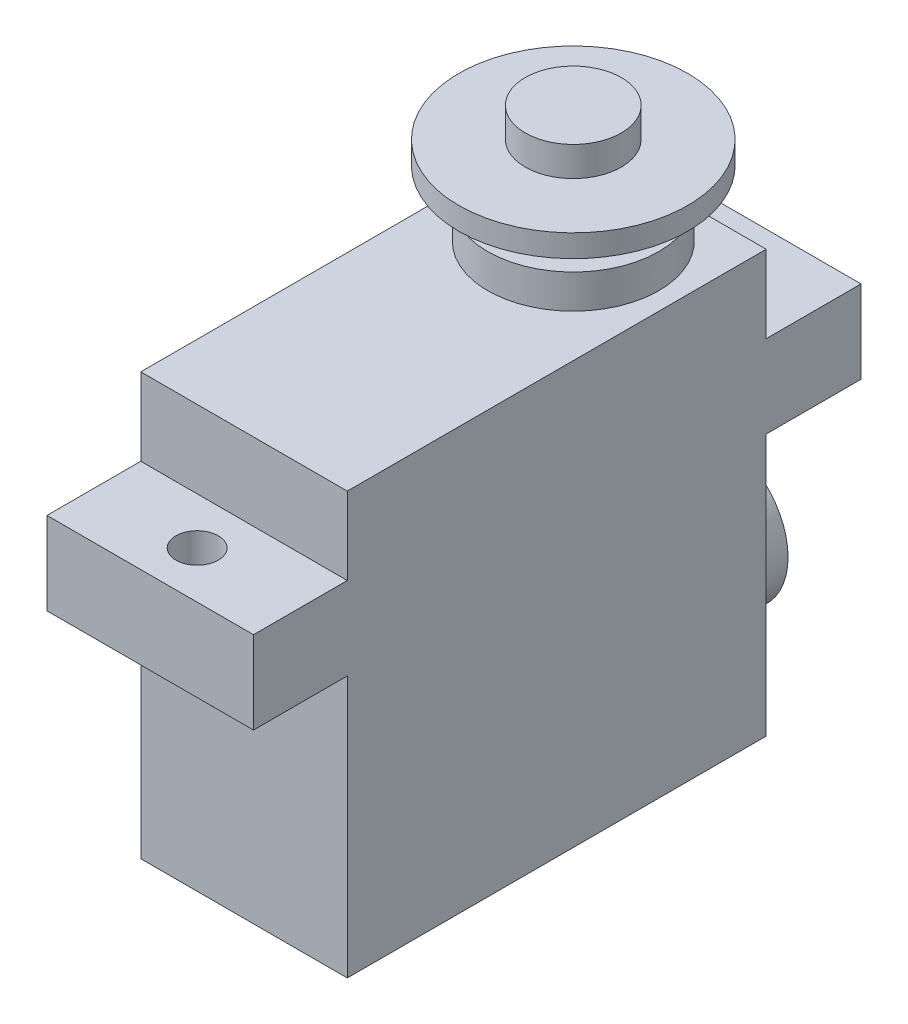
ISO-10303-21;
HEADER;
FILE_DESCRIPTION(('STEP AP214'),'2;1');
FILE_NAME('part.step','',(''),(''),'','','');
FILE_SCHEMA(('AUTOMOTIVE_DESIGN { 1 0 10303 214 1 1 1 1 }'));
ENDSEC;
DATA;
#1=APPLICATION_CONTEXT('core data for automotive mechanical design processes');
#2=APPLICATION_PROTOCOL_DEFINITION('international standard','automotive_design',2000,#1);
#3=PRODUCT_CONTEXT('',#1,'mechanical');
#4=PRODUCT('Part','Part','',(#3));
#5=PRODUCT_RELATED_PRODUCT_CATEGORY('part','',(#4));
#6=PRODUCT_DEFINITION_FORMATION('','',#4);
#7=PRODUCT_DEFINITION_CONTEXT('part definition',#1,'design');
#8=PRODUCT_DEFINITION('design','',#6,#7);
#9=PRODUCT_DEFINITION_SHAPE('','',#8);
#10=(LENGTH_UNIT() NAMED_UNIT(*) SI_UNIT(.MILLI.,.METRE.));
#11=(NAMED_UNIT(*) PLANE_ANGLE_UNIT() SI_UNIT($,.RADIAN.));
#12=(NAMED_UNIT(*) SI_UNIT($,.STERADIAN.) SOLID_ANGLE_UNIT());
#13=UNCERTAINTY_MEASURE_WITH_UNIT(LENGTH_MEASURE(1.E-05),#10,'distance_accuracy_value','');
#14=(GEOMETRIC_REPRESENTATION_CONTEXT(3) GLOBAL_UNCERTAINTY_ASSIGNED_CONTEXT((#13)) GLOBAL_UNIT_ASSIGNED_CONTEXT((#10,
#11,#12)) REPRESENTATION_CONTEXT('',''));
#15=CARTESIAN_POINT('',(0.,0.,0.));
#16=DIRECTION('',(0.,0.,1.));
#17=DIRECTION('',(1.,0.,0.));
#18=AXIS2_PLACEMENT_3D('',#15,#16,#17);
#19=CARTESIAN_POINT('',(0.,31.115,0.));
#20=DIRECTION('',(0.,0.,-1.));
#21=DIRECTION('',(-1.,0.,0.));
#22=AXIS2_PLACEMENT_3D('',#19,#20,#21);
#23=PLANE('',#22);
#24=DIRECTION('',(0.,-1.,0.));
#25=VECTOR('',#24,1.);
#26=CARTESIAN_POINT('',(0.,31.115,0.));
#27=LINE('',#26,#25);
#28=CARTESIAN_POINT('',(0.,31.115,0.));
#29=VERTEX_POINT('',#28);
#30=CARTESIAN_POINT('',(0.,25.4,0.));
#31=VERTEX_POINT('',#30);
#32=EDGE_CURVE('E221',#29,#31,#27,.T.);
#33=ORIENTED_EDGE('',*,*,#32,.T.);
#34=DIRECTION('',(1.,0.,0.));
#35=VECTOR('',#34,1.);
#36=CARTESIAN_POINT('',(0.,25.4,0.));
#37=LINE('',#36,#35);
#38=CARTESIAN_POINT('',(15.2399999999999,25.4,0.));
#39=VERTEX_POINT('',#38);
#40=EDGE_CURVE('E186',#31,#39,#37,.T.);
#41=ORIENTED_EDGE('',*,*,#40,.T.);
#42=DIRECTION('',(0.,-1.,0.));
#43=VECTOR('',#42,1.);
#44=CARTESIAN_POINT('',(15.2399999999999,31.115,0.));
#45=LINE('',#44,#43);
#46=CARTESIAN_POINT('',(15.2399999999999,31.115,0.));
#47=VERTEX_POINT('',#46);
#48=EDGE_CURVE('E218',#47,#39,#45,.T.);
#49=ORIENTED_EDGE('',*,*,#48,.F.);
#50=DIRECTION('',(1.,0.,0.));
#51=VECTOR('',#50,1.);
#52=CARTESIAN_POINT('',(0.,31.115,0.));
#53=LINE('',#52,#51);
#54=EDGE_CURVE('E193',#29,#47,#53,.T.);
#55=ORIENTED_EDGE('',*,*,#54,.F.);
#56=EDGE_LOOP('',(#33,#41,#49,#55));
#57=FACE_BOUND('',#56,.T.);
#58=ADVANCED_FACE('F43',(#57),#23,.F.);
#59=CARTESIAN_POINT('',(0.,31.115,-30.9117999999999));
#60=DIRECTION('',(0.,0.,1.));
#61=DIRECTION('',(1.,0.,0.));
#62=AXIS2_PLACEMENT_3D('',#59,#60,#61);
#63=PLANE('',#62);
#64=DIRECTION('',(0.,-1.,0.));
#65=VECTOR('',#64,1.);
#66=CARTESIAN_POINT('',(15.2399999999999,31.115,-30.9118));
#67=LINE('',#66,#65);
#68=CARTESIAN_POINT('',(15.2399999999999,31.115,-30.9118));
#69=VERTEX_POINT('',#68);
#70=CARTESIAN_POINT('',(15.2399999999999,25.4,-30.9118));
#71=VERTEX_POINT('',#70);
#72=EDGE_CURVE('E214',#69,#71,#67,.T.);
#73=ORIENTED_EDGE('',*,*,#72,.T.);
#74=DIRECTION('',(-1.,0.,0.));
#75=VECTOR('',#74,1.);
#76=CARTESIAN_POINT('',(0.,25.4,-30.9117999999999));
#77=LINE('',#76,#75);
#78=CARTESIAN_POINT('',(0.,25.4,-30.9118));
#79=VERTEX_POINT('',#78);
#80=EDGE_CURVE('E226',#71,#79,#77,.T.);
#81=ORIENTED_EDGE('',*,*,#80,.T.);
#82=DIRECTION('',(0.,-1.,0.));
#83=VECTOR('',#82,1.);
#84=CARTESIAN_POINT('',(0.,31.115,-30.9117999999999));
#85=LINE('',#84,#83);
#86=CARTESIAN_POINT('',(0.,31.115,-30.9117999999999));
#87=VERTEX_POINT('',#86);
#88=EDGE_CURVE('E210',#87,#79,#85,.T.);
#89=ORIENTED_EDGE('',*,*,#88,.F.);
#90=DIRECTION('',(-1.,0.,0.));
#91=VECTOR('',#90,1.);
#92=CARTESIAN_POINT('',(0.,31.115,-30.9117999999999));
#93=LINE('',#92,#91);
#94=EDGE_CURVE('E198',#69,#87,#93,.T.);
#95=ORIENTED_EDGE('',*,*,#94,.F.);
#96=EDGE_LOOP('',(#73,#81,#89,#95));
#97=FACE_BOUND('',#96,.T.);
#98=ADVANCED_FACE('F296',(#97),#63,.F.);
#99=CARTESIAN_POINT('',(0.,31.115,0.));
#100=DIRECTION('',(1.,0.,0.));
#101=DIRECTION('',(0.,0.,-1.));
#102=AXIS2_PLACEMENT_3D('',#99,#100,#101);
#103=PLANE('',#102);
#104=CARTESIAN_POINT('',(0.,19.304,0.));
#105=VERTEX_POINT('',#104);
#106=CARTESIAN_POINT('',(0.,0.,0.));
#107=VERTEX_POINT('',#106);
#108=EDGE_CURVE('E138',#105,#107,#27,.T.);
#109=ORIENTED_EDGE('',*,*,#108,.F.);
#110=DIRECTION('',(0.,0.,1.));
#111=VECTOR('',#110,1.);
#112=CARTESIAN_POINT('',(0.,19.304,-37.9095));
#113=LINE('',#112,#111);
#114=CARTESIAN_POINT('',(0.,19.304,6.9215));
#115=VERTEX_POINT('',#114);
#116=EDGE_CURVE('E60',#105,#115,#113,.T.);
#117=ORIENTED_EDGE('',*,*,#116,.T.);
#118=DIRECTION('',(0.,-1.,0.));
#119=VECTOR('',#118,1.);
#120=CARTESIAN_POINT('',(0.,25.4,6.9215));
#121=LINE('',#120,#119);
#122=CARTESIAN_POINT('',(0.,25.4,6.9215));
#123=VERTEX_POINT('',#122);
#124=EDGE_CURVE('E136',#123,#115,#121,.T.);
#125=ORIENTED_EDGE('',*,*,#124,.F.);
#126=DIRECTION('',(0.,0.,1.));
#127=VECTOR('',#126,1.);
#128=CARTESIAN_POINT('',(0.,25.4,-37.9095));
#129=LINE('',#128,#127);
#130=EDGE_CURVE('E178',#31,#123,#129,.T.);
#131=ORIENTED_EDGE('',*,*,#130,.F.);
#132=ORIENTED_EDGE('',*,*,#32,.F.);
#133=DIRECTION('',(0.,0.,1.));
#134=VECTOR('',#133,1.);
#135=CARTESIAN_POINT('',(0.,31.115,0.));
#136=LINE('',#135,#134);
#137=EDGE_CURVE('E190',#87,#29,#136,.T.);
#138=ORIENTED_EDGE('',*,*,#137,.F.);
#139=ORIENTED_EDGE('',*,*,#88,.T.);
#140=CARTESIAN_POINT('',(0.,25.4,-37.9095));
#141=VERTEX_POINT('',#140);
#142=EDGE_CURVE('E175',#141,#79,#129,.T.);
#143=ORIENTED_EDGE('',*,*,#142,.F.);
#144=DIRECTION('',(0.,-1.,0.));
#145=VECTOR('',#144,1.);
#146=CARTESIAN_POINT('',(0.,25.4,-37.9095));
#147=LINE('',#146,#145);
#148=CARTESIAN_POINT('',(0.,19.304,-37.9095));
#149=VERTEX_POINT('',#148);
#150=EDGE_CURVE('E165',#141,#149,#147,.T.);
#151=ORIENTED_EDGE('',*,*,#150,.T.);
#152=CARTESIAN_POINT('',(0.,19.304,-30.9118));
#153=VERTEX_POINT('',#152);
#154=EDGE_CURVE('E139',#149,#153,#113,.T.);
#155=ORIENTED_EDGE('',*,*,#154,.T.);
#156=CARTESIAN_POINT('',(0.,0.,-30.9117999999999));
#157=VERTEX_POINT('',#156);
#158=EDGE_CURVE('E200',#153,#157,#85,.T.);
#159=ORIENTED_EDGE('',*,*,#158,.T.);
#160=DIRECTION('',(0.,0.,1.));
#161=VECTOR('',#160,1.);
#162=CARTESIAN_POINT('',(0.,0.,0.));
#163=LINE('',#162,#161);
#164=EDGE_CURVE('E189',#157,#107,#163,.T.);
#165=ORIENTED_EDGE('',*,*,#164,.T.);
#166=EDGE_LOOP('',(#109,#117,#125,#131,#132,#138,#139,#143,#151,#155,#159,#165));
#167=FACE_BOUND('',#166,.T.);
#168=ADVANCED_FACE('F45',(#167),#103,.F.);
#169=CARTESIAN_POINT('',(15.2399999999999,19.304,0.));
#170=VERTEX_POINT('',#169);
#171=CARTESIAN_POINT('',(15.2399999999999,0.,0.));
#172=VERTEX_POINT('',#171);
#173=EDGE_CURVE('E217',#170,#172,#45,.T.);
#174=ORIENTED_EDGE('',*,*,#173,.F.);
#175=DIRECTION('',(-1.,0.,0.));
#176=VECTOR('',#175,1.);
#177=CARTESIAN_POINT('',(0.,19.304,0.));
#178=LINE('',#177,#176);
#179=EDGE_CURVE('E177',#170,#105,#178,.T.);
#180=ORIENTED_EDGE('',*,*,#179,.T.);
#181=ORIENTED_EDGE('',*,*,#108,.T.);
#182=DIRECTION('',(1.,0.,0.));
#183=VECTOR('',#182,1.);
#184=CARTESIAN_POINT('',(0.,0.,0.));
#185=LINE('',#184,#183);
#186=EDGE_CURVE('E202',#107,#172,#185,.T.);
#187=ORIENTED_EDGE('',*,*,#186,.T.);
#188=EDGE_LOOP('',(#174,#180,#181,#187));
#189=FACE_BOUND('',#188,.T.);
#190=ADVANCED_FACE('F319',(#189),#23,.F.);
#191=CARTESIAN_POINT('',(15.2399999999999,31.115,0.));
#192=DIRECTION('',(-1.,0.,0.));
#193=DIRECTION('',(0.,0.,1.));
#194=AXIS2_PLACEMENT_3D('',#191,#192,#193);
#195=PLANE('',#194);
#196=CARTESIAN_POINT('',(15.2399999999999,19.304,-30.9118));
#197=VERTEX_POINT('',#196);
#198=CARTESIAN_POINT('',(15.2399999999999,0.,-30.9118));
#199=VERTEX_POINT('',#198);
#200=EDGE_CURVE('E213',#197,#199,#67,.T.);
#201=ORIENTED_EDGE('',*,*,#200,.F.);
#202=DIRECTION('',(0.,0.,1.));
#203=VECTOR('',#202,1.);
#204=CARTESIAN_POINT('',(15.2399999999999,19.304,-37.9095));
#205=LINE('',#204,#203);
#206=CARTESIAN_POINT('',(15.2399999999999,19.304,-37.9095));
#207=VERTEX_POINT('',#206);
#208=EDGE_CURVE('E68',#207,#197,#205,.T.);
#209=ORIENTED_EDGE('',*,*,#208,.F.);
#210=DIRECTION('',(0.,1.,0.));
#211=VECTOR('',#210,1.);
#212=CARTESIAN_POINT('',(15.2399999999999,25.4,-37.9095));
#213=LINE('',#212,#211);
#214=CARTESIAN_POINT('',(15.2399999999999,25.4,-37.9095));
#215=VERTEX_POINT('',#214);
#216=EDGE_CURVE('E170',#207,#215,#213,.T.);
#217=ORIENTED_EDGE('',*,*,#216,.T.);
#218=DIRECTION('',(0.,0.,1.));
#219=VECTOR('',#218,1.);
#220=CARTESIAN_POINT('',(15.2399999999999,25.4,-37.9095));
#221=LINE('',#220,#219);
#222=EDGE_CURVE('E179',#215,#71,#221,.T.);
#223=ORIENTED_EDGE('',*,*,#222,.T.);
#224=ORIENTED_EDGE('',*,*,#72,.F.);
#225=DIRECTION('',(0.,0.,-1.));
#226=VECTOR('',#225,1.);
#227=CARTESIAN_POINT('',(15.2399999999999,31.115,0.));
#228=LINE('',#227,#226);
#229=EDGE_CURVE('E196',#47,#69,#228,.T.);
#230=ORIENTED_EDGE('',*,*,#229,.F.);
#231=ORIENTED_EDGE('',*,*,#48,.T.);
#232=CARTESIAN_POINT('',(15.2399999999999,25.4,6.9215));
#233=VERTEX_POINT('',#232);
#234=EDGE_CURVE('E182',#39,#233,#221,.T.);
#235=ORIENTED_EDGE('',*,*,#234,.T.);
#236=DIRECTION('',(0.,1.,0.));
#237=VECTOR('',#236,1.);
#238=CARTESIAN_POINT('',(15.2399999999999,25.4,6.9215));
#239=LINE('',#238,#237);
#240=CARTESIAN_POINT('',(15.2399999999999,19.304,6.9215));
#241=VERTEX_POINT('',#240);
#242=EDGE_CURVE('E150',#241,#233,#239,.T.);
#243=ORIENTED_EDGE('',*,*,#242,.F.);
#244=EDGE_CURVE('E146',#170,#241,#205,.T.);
#245=ORIENTED_EDGE('',*,*,#244,.F.);
#246=ORIENTED_EDGE('',*,*,#173,.T.);
#247=DIRECTION('',(0.,0.,-1.));
#248=VECTOR('',#247,1.);
#249=CARTESIAN_POINT('',(15.2399999999999,0.,0.));
#250=LINE('',#249,#248);
#251=EDGE_CURVE('E205',#172,#199,#250,.T.);
#252=ORIENTED_EDGE('',*,*,#251,.T.);
#253=EDGE_LOOP('',(#201,#209,#217,#223,#224,#230,#231,#235,#243,#245,#246,#252));
#254=FACE_BOUND('',#253,.T.);
#255=ADVANCED_FACE('F291',(#254),#195,.F.);
#256=CARTESIAN_POINT('',(7.61999999999996,8.2804,-30.9118));
#257=DIRECTION('',(0.,0.,1.));
#258=DIRECTION('',(1.,0.,0.));
#259=AXIS2_PLACEMENT_3D('',#256,#257,#258);
#260=CIRCLE('',#259,5.2705);
#261=CARTESIAN_POINT('',(12.8905,8.2804,-30.9118));
#262=VERTEX_POINT('',#261);
#263=EDGE_CURVE('E228',#262,#262,#260,.F.);
#264=ORIENTED_EDGE('',*,*,#263,.F.);
#265=EDGE_LOOP('',(#264));
#266=FACE_BOUND('',#265,.T.);
#267=ORIENTED_EDGE('',*,*,#158,.F.);
#268=DIRECTION('',(1.,0.,0.));
#269=VECTOR('',#268,1.);
#270=CARTESIAN_POINT('',(0.,19.304,-30.9117999999999));
#271=LINE('',#270,#269);
#272=EDGE_CURVE('E224',#153,#197,#271,.T.);
#273=ORIENTED_EDGE('',*,*,#272,.T.);
#274=ORIENTED_EDGE('',*,*,#200,.T.);
#275=DIRECTION('',(-1.,0.,0.));
#276=VECTOR('',#275,1.);
#277=CARTESIAN_POINT('',(0.,0.,-30.9117999999999));
#278=LINE('',#277,#276);
#279=EDGE_CURVE('E194',#199,#157,#278,.T.);
#280=ORIENTED_EDGE('',*,*,#279,.T.);
#281=EDGE_LOOP('',(#267,#273,#274,#280));
#282=FACE_BOUND('',#281,.T.);
#283=ADVANCED_FACE('F310',(#266,#282),#63,.F.);
#284=CARTESIAN_POINT('',(0.,31.115,0.));
#285=DIRECTION('',(0.,-1.,0.));
#286=DIRECTION('',(0.,0.,-1.));
#287=AXIS2_PLACEMENT_3D('',#284,#285,#286);
#288=PLANE('',#287);
#289=CARTESIAN_POINT('',(7.61999999999996,31.115,-24.2951));
#290=DIRECTION('',(0.,-1.,0.));
#291=DIRECTION('',(0.,0.,-1.));
#292=AXIS2_PLACEMENT_3D('',#289,#290,#291);
#293=CIRCLE('',#292,6.3119);
#294=CARTESIAN_POINT('',(7.61999999999996,31.115,-30.607));
#295=VERTEX_POINT('',#294);
#296=EDGE_CURVE('E47',#295,#295,#293,.F.);
#297=ORIENTED_EDGE('',*,*,#296,.F.);
#298=EDGE_LOOP('',(#297));
#299=FACE_BOUND('',#298,.T.);
#300=ORIENTED_EDGE('',*,*,#137,.T.);
#301=ORIENTED_EDGE('',*,*,#54,.T.);
#302=ORIENTED_EDGE('',*,*,#229,.T.);
#303=ORIENTED_EDGE('',*,*,#94,.T.);
#304=EDGE_LOOP('',(#300,#301,#302,#303));
#305=FACE_BOUND('',#304,.T.);
#306=ADVANCED_FACE('F299',(#299,#305),#288,.F.);
#307=CARTESIAN_POINT('',(0.,0.,0.));
#308=DIRECTION('',(0.,-1.,0.));
#309=DIRECTION('',(0.,0.,-1.));
#310=AXIS2_PLACEMENT_3D('',#307,#308,#309);
#311=PLANE('',#310);
#312=ORIENTED_EDGE('',*,*,#164,.F.);
#313=ORIENTED_EDGE('',*,*,#279,.F.);
#314=ORIENTED_EDGE('',*,*,#251,.F.);
#315=ORIENTED_EDGE('',*,*,#186,.F.);
#316=EDGE_LOOP('',(#312,#313,#314,#315));
#317=FACE_BOUND('',#316,.T.);
#318=ADVANCED_FACE('F316',(#317),#311,.T.);
#319=CARTESIAN_POINT('',(0.,0.,-37.9095));
#320=DIRECTION('',(0.,0.,1.));
#321=DIRECTION('',(1.,0.,0.));
#322=AXIS2_PLACEMENT_3D('',#319,#320,#321);
#323=PLANE('',#322);
#324=ORIENTED_EDGE('',*,*,#150,.F.);
#325=DIRECTION('',(-1.,0.,0.));
#326=VECTOR('',#325,1.);
#327=CARTESIAN_POINT('',(0.,25.4,-37.9095));
#328=LINE('',#327,#326);
#329=EDGE_CURVE('E140',#215,#141,#328,.T.);
#330=ORIENTED_EDGE('',*,*,#329,.F.);
#331=ORIENTED_EDGE('',*,*,#216,.F.);
#332=DIRECTION('',(1.,0.,0.));
#333=VECTOR('',#332,1.);
#334=CARTESIAN_POINT('',(0.,19.304,-37.9095));
#335=LINE('',#334,#333);
#336=EDGE_CURVE('E168',#149,#207,#335,.T.);
#337=ORIENTED_EDGE('',*,*,#336,.F.);
#338=EDGE_LOOP('',(#324,#330,#331,#337));
#339=FACE_BOUND('',#338,.T.);
#340=ADVANCED_FACE('F307',(#339),#323,.F.);
#341=CARTESIAN_POINT('',(0.,19.304,-37.9095));
#342=DIRECTION('',(0.,-1.,0.));
#343=DIRECTION('',(0.,0.,-1.));
#344=AXIS2_PLACEMENT_3D('',#341,#342,#343);
#345=PLANE('',#344);
#346=CARTESIAN_POINT('',(7.61999999999996,19.304,-34.41065));
#347=DIRECTION('',(0.,-1.,0.));
#348=DIRECTION('',(0.,0.,-1.));
#349=AXIS2_PLACEMENT_3D('',#346,#347,#348);
#350=CIRCLE('',#349,1.5621);
#351=CARTESIAN_POINT('',(7.61999999999996,19.304,-35.97275));
#352=VERTEX_POINT('',#351);
#353=EDGE_CURVE('E268',#352,#352,#350,.F.);
#354=ORIENTED_EDGE('',*,*,#353,.T.);
#355=EDGE_LOOP('',(#354));
#356=FACE_BOUND('',#355,.T.);
#357=ORIENTED_EDGE('',*,*,#272,.F.);
#358=ORIENTED_EDGE('',*,*,#154,.F.);
#359=ORIENTED_EDGE('',*,*,#336,.T.);
#360=ORIENTED_EDGE('',*,*,#208,.T.);
#361=EDGE_LOOP('',(#357,#358,#359,#360));
#362=FACE_BOUND('',#361,.T.);
#363=ADVANCED_FACE('F272',(#356,#362),#345,.T.);
#364=CARTESIAN_POINT('',(0.,25.4,-37.9095));
#365=DIRECTION('',(0.,1.,0.));
#366=DIRECTION('',(0.,0.,1.));
#367=AXIS2_PLACEMENT_3D('',#364,#365,#366);
#368=PLANE('',#367);
#369=CARTESIAN_POINT('',(7.61999999999996,25.4,-34.41065));
#370=DIRECTION('',(0.,1.,0.));
#371=DIRECTION('',(0.,0.,1.));
#372=AXIS2_PLACEMENT_3D('',#369,#370,#371);
#373=CIRCLE('',#372,1.5621);
#374=CARTESIAN_POINT('',(7.61999999999996,25.4,-32.84855));
#375=VERTEX_POINT('',#374);
#376=EDGE_CURVE('E263',#375,#375,#373,.T.);
#377=ORIENTED_EDGE('',*,*,#376,.F.);
#378=EDGE_LOOP('',(#377));
#379=FACE_BOUND('',#378,.T.);
#380=ORIENTED_EDGE('',*,*,#80,.F.);
#381=ORIENTED_EDGE('',*,*,#222,.F.);
#382=ORIENTED_EDGE('',*,*,#329,.T.);
#383=ORIENTED_EDGE('',*,*,#142,.T.);
#384=EDGE_LOOP('',(#380,#381,#382,#383));
#385=FACE_BOUND('',#384,.T.);
#386=ADVANCED_FACE('F281',(#379,#385),#368,.T.);
#387=CARTESIAN_POINT('',(7.61999999999996,25.4,3.46075));
#388=DIRECTION('',(0.,1.,0.));
#389=DIRECTION('',(0.,0.,1.));
#390=AXIS2_PLACEMENT_3D('',#387,#388,#389);
#391=CIRCLE('',#390,1.5621);
#392=CARTESIAN_POINT('',(7.61999999999996,25.4,5.02285));
#393=VERTEX_POINT('',#392);
#394=EDGE_CURVE('E259',#393,#393,#391,.T.);
#395=ORIENTED_EDGE('',*,*,#394,.F.);
#396=EDGE_LOOP('',(#395));
#397=FACE_BOUND('',#396,.T.);
#398=ORIENTED_EDGE('',*,*,#40,.F.);
#399=ORIENTED_EDGE('',*,*,#130,.T.);
#400=DIRECTION('',(-1.,0.,0.));
#401=VECTOR('',#400,1.);
#402=CARTESIAN_POINT('',(0.,25.4,6.9215));
#403=LINE('',#402,#401);
#404=EDGE_CURVE('E155',#233,#123,#403,.T.);
#405=ORIENTED_EDGE('',*,*,#404,.F.);
#406=ORIENTED_EDGE('',*,*,#234,.F.);
#407=EDGE_LOOP('',(#398,#399,#405,#406));
#408=FACE_BOUND('',#407,.T.);
#409=ADVANCED_FACE('F284',(#397,#408),#368,.T.);
#410=CARTESIAN_POINT('',(7.61999999999996,19.304,3.46075));
#411=DIRECTION('',(0.,-1.,0.));
#412=DIRECTION('',(0.,0.,-1.));
#413=AXIS2_PLACEMENT_3D('',#410,#411,#412);
#414=CIRCLE('',#413,1.5621);
#415=CARTESIAN_POINT('',(7.61999999999996,19.304,1.89865));
#416=VERTEX_POINT('',#415);
#417=EDGE_CURVE('E260',#416,#416,#414,.F.);
#418=ORIENTED_EDGE('',*,*,#417,.T.);
#419=EDGE_LOOP('',(#418));
#420=FACE_BOUND('',#419,.T.);
#421=ORIENTED_EDGE('',*,*,#179,.F.);
#422=ORIENTED_EDGE('',*,*,#244,.T.);
#423=DIRECTION('',(1.,0.,0.));
#424=VECTOR('',#423,1.);
#425=CARTESIAN_POINT('',(0.,19.304,6.9215));
#426=LINE('',#425,#424);
#427=EDGE_CURVE('E143',#115,#241,#426,.T.);
#428=ORIENTED_EDGE('',*,*,#427,.F.);
#429=ORIENTED_EDGE('',*,*,#116,.F.);
#430=EDGE_LOOP('',(#421,#422,#428,#429));
#431=FACE_BOUND('',#430,.T.);
#432=ADVANCED_FACE('F144',(#420,#431),#345,.T.);
#433=CARTESIAN_POINT('',(0.,0.,6.9215));
#434=DIRECTION('',(0.,0.,1.));
#435=DIRECTION('',(1.,0.,0.));
#436=AXIS2_PLACEMENT_3D('',#433,#434,#435);
#437=PLANE('',#436);
#438=ORIENTED_EDGE('',*,*,#124,.T.);
#439=ORIENTED_EDGE('',*,*,#427,.T.);
#440=ORIENTED_EDGE('',*,*,#242,.T.);
#441=ORIENTED_EDGE('',*,*,#404,.T.);
#442=EDGE_LOOP('',(#438,#439,#440,#441));
#443=FACE_BOUND('',#442,.T.);
#444=ADVANCED_FACE('F153',(#443),#437,.T.);
#445=CARTESIAN_POINT('',(7.61999999999994,8.2804,-34.8742));
#446=DIRECTION('',(0.,0.,1.));
#447=DIRECTION('',(1.,0.,0.));
#448=AXIS2_PLACEMENT_3D('',#445,#446,#447);
#449=CYLINDRICAL_SURFACE('',#448,5.2705);
#450=CARTESIAN_POINT('',(7.61999999999994,8.2804,-34.8742));
#451=DIRECTION('',(0.,0.,-1.));
#452=DIRECTION('',(-1.,0.,0.));
#453=AXIS2_PLACEMENT_3D('',#450,#451,#452);
#454=CIRCLE('',#453,5.2705);
#455=CARTESIAN_POINT('',(2.34949999999994,8.2804,-34.8741999999999));
#456=VERTEX_POINT('',#455);
#457=EDGE_CURVE('E156',#456,#456,#454,.T.);
#458=ORIENTED_EDGE('',*,*,#457,.F.);
#459=EDGE_LOOP('',(#458));
#460=FACE_BOUND('',#459,.T.);
#461=ORIENTED_EDGE('',*,*,#263,.T.);
#462=EDGE_LOOP('',(#461));
#463=FACE_BOUND('',#462,.T.);
#464=ADVANCED_FACE('F354',(#460,#463),#449,.T.);
#465=CARTESIAN_POINT('',(7.61999999999994,8.2804,-34.8742));
#466=DIRECTION('',(0.,0.,-1.));
#467=DIRECTION('',(-1.,0.,0.));
#468=AXIS2_PLACEMENT_3D('',#465,#466,#467);
#469=PLANE('',#468);
#470=ORIENTED_EDGE('',*,*,#457,.T.);
#471=EDGE_LOOP('',(#470));
#472=FACE_BOUND('',#471,.T.);
#473=ADVANCED_FACE('F357',(#472),#469,.T.);
#474=CARTESIAN_POINT('',(7.61999999999996,33.6169,-24.2951));
#475=DIRECTION('',(0.,-1.,0.));
#476=DIRECTION('',(0.,0.,-1.));
#477=AXIS2_PLACEMENT_3D('',#474,#475,#476);
#478=CYLINDRICAL_SURFACE('',#477,6.3119);
#479=CARTESIAN_POINT('',(7.61999999999996,33.6169,-24.2951));
#480=DIRECTION('',(0.,1.,0.));
#481=DIRECTION('',(0.,0.,1.));
#482=AXIS2_PLACEMENT_3D('',#479,#480,#481);
#483=CIRCLE('',#482,6.3119);
#484=CARTESIAN_POINT('',(7.61999999999996,33.6169,-17.9832));
#485=VERTEX_POINT('',#484);
#486=EDGE_CURVE('E159',#485,#485,#483,.T.);
#487=ORIENTED_EDGE('',*,*,#486,.F.);
#488=EDGE_LOOP('',(#487));
#489=FACE_BOUND('',#488,.T.);
#490=ORIENTED_EDGE('',*,*,#296,.T.);
#491=EDGE_LOOP('',(#490));
#492=FACE_BOUND('',#491,.T.);
#493=ADVANCED_FACE('F361',(#489,#492),#478,.T.);
#494=CARTESIAN_POINT('',(7.61999999999996,33.6169,-24.2951));
#495=DIRECTION('',(0.,1.,0.));
#496=DIRECTION('',(0.,0.,1.));
#497=AXIS2_PLACEMENT_3D('',#494,#495,#496);
#498=PLANE('',#497);
#499=CARTESIAN_POINT('',(7.61999999999996,33.6169,-24.2951));
#500=DIRECTION('',(0.,1.,0.));
#501=DIRECTION('',(0.,0.,1.));
#502=AXIS2_PLACEMENT_3D('',#499,#500,#501);
#503=CIRCLE('',#502,3.99415);
#504=CARTESIAN_POINT('',(7.61999999999996,33.6169,-20.30095));
#505=VERTEX_POINT('',#504);
#506=EDGE_CURVE('E52',#505,#505,#503,.T.);
#507=ORIENTED_EDGE('',*,*,#506,.F.);
#508=EDGE_LOOP('',(#507));
#509=FACE_BOUND('',#508,.T.);
#510=ORIENTED_EDGE('',*,*,#486,.T.);
#511=EDGE_LOOP('',(#510));
#512=FACE_BOUND('',#511,.T.);
#513=ADVANCED_FACE('F365',(#509,#512),#498,.T.);
#514=CARTESIAN_POINT('',(7.61999999999996,35.9791,-24.2951));
#515=DIRECTION('',(0.,-1.,0.));
#516=DIRECTION('',(0.,0.,-1.));
#517=AXIS2_PLACEMENT_3D('',#514,#515,#516);
#518=CYLINDRICAL_SURFACE('',#517,3.99415);
#519=CARTESIAN_POINT('',(7.61999999999996,35.9791,-24.2951));
#520=DIRECTION('',(0.,1.,0.));
#521=DIRECTION('',(0.,0.,1.));
#522=AXIS2_PLACEMENT_3D('',#519,#520,#521);
#523=CIRCLE('',#522,3.99415);
#524=CARTESIAN_POINT('',(7.61999999999996,35.9791,-20.30095));
#525=VERTEX_POINT('',#524);
#526=EDGE_CURVE('E240',#525,#525,#523,.T.);
#527=ORIENTED_EDGE('',*,*,#526,.F.);
#528=EDGE_LOOP('',(#527));
#529=FACE_BOUND('',#528,.T.);
#530=ORIENTED_EDGE('',*,*,#506,.T.);
#531=EDGE_LOOP('',(#530));
#532=FACE_BOUND('',#531,.T.);
#533=ADVANCED_FACE('F369',(#529,#532),#518,.T.);
#534=CARTESIAN_POINT('',(7.61999999999996,37.6301,-24.2951));
#535=DIRECTION('',(0.,-1.,0.));
#536=DIRECTION('',(0.,0.,-1.));
#537=AXIS2_PLACEMENT_3D('',#534,#535,#536);
#538=CYLINDRICAL_SURFACE('',#537,8.4455);
#539=CARTESIAN_POINT('',(7.61999999999996,37.6301,-24.2951));
#540=DIRECTION('',(0.,1.,0.));
#541=DIRECTION('',(0.,0.,1.));
#542=AXIS2_PLACEMENT_3D('',#539,#540,#541);
#543=CIRCLE('',#542,8.4455);
#544=CARTESIAN_POINT('',(7.61999999999996,37.6301,-15.8496));
#545=VERTEX_POINT('',#544);
#546=EDGE_CURVE('E246',#545,#545,#543,.T.);
#547=ORIENTED_EDGE('',*,*,#546,.F.);
#548=EDGE_LOOP('',(#547));
#549=FACE_BOUND('',#548,.T.);
#550=CARTESIAN_POINT('',(7.61999999999996,35.9791,-24.2951));
#551=DIRECTION('',(0.,1.,0.));
#552=DIRECTION('',(0.,0.,1.));
#553=AXIS2_PLACEMENT_3D('',#550,#551,#552);
#554=CIRCLE('',#553,8.4455);
#555=CARTESIAN_POINT('',(7.61999999999996,35.9791,-15.8496));
#556=VERTEX_POINT('',#555);
#557=EDGE_CURVE('E250',#556,#556,#554,.T.);
#558=ORIENTED_EDGE('',*,*,#557,.T.);
#559=EDGE_LOOP('',(#558));
#560=FACE_BOUND('',#559,.T.);
#561=ADVANCED_FACE('F373',(#549,#560),#538,.T.);
#562=CARTESIAN_POINT('',(7.61999999999996,37.6301,-24.2951));
#563=DIRECTION('',(0.,1.,0.));
#564=DIRECTION('',(0.,0.,1.));
#565=AXIS2_PLACEMENT_3D('',#562,#563,#564);
#566=PLANE('',#565);
#567=CARTESIAN_POINT('',(7.61999999999996,37.6301,-24.2951));
#568=DIRECTION('',(0.,1.,0.));
#569=DIRECTION('',(0.,0.,1.));
#570=AXIS2_PLACEMENT_3D('',#567,#568,#569);
#571=CIRCLE('',#570,3.5433);
#572=CARTESIAN_POINT('',(7.61999999999996,37.6301,-20.7518));
#573=VERTEX_POINT('',#572);
#574=EDGE_CURVE('E11',#573,#573,#571,.T.);
#575=ORIENTED_EDGE('',*,*,#574,.F.);
#576=EDGE_LOOP('',(#575));
#577=FACE_BOUND('',#576,.T.);
#578=ORIENTED_EDGE('',*,*,#546,.T.);
#579=EDGE_LOOP('',(#578));
#580=FACE_BOUND('',#579,.T.);
#581=ADVANCED_FACE('F377',(#577,#580),#566,.T.);
#582=CARTESIAN_POINT('',(7.61999999999996,35.9791,-24.2951));
#583=DIRECTION('',(0.,1.,0.));
#584=DIRECTION('',(0.,0.,1.));
#585=AXIS2_PLACEMENT_3D('',#582,#583,#584);
#586=PLANE('',#585);
#587=ORIENTED_EDGE('',*,*,#526,.T.);
#588=EDGE_LOOP('',(#587));
#589=FACE_BOUND('',#588,.T.);
#590=ORIENTED_EDGE('',*,*,#557,.F.);
#591=EDGE_LOOP('',(#590));
#592=FACE_BOUND('',#591,.T.);
#593=ADVANCED_FACE('F379',(#589,#592),#586,.F.);
#594=CARTESIAN_POINT('',(7.61999999999996,39.8145,-24.2951));
#595=DIRECTION('',(0.,-1.,0.));
#596=DIRECTION('',(0.,0.,-1.));
#597=AXIS2_PLACEMENT_3D('',#594,#595,#596);
#598=CYLINDRICAL_SURFACE('',#597,3.5433);
#599=CARTESIAN_POINT('',(7.61999999999996,39.8145,-24.2951));
#600=DIRECTION('',(0.,1.,0.));
#601=DIRECTION('',(0.,0.,1.));
#602=AXIS2_PLACEMENT_3D('',#599,#600,#601);
#603=CIRCLE('',#602,3.5433);
#604=CARTESIAN_POINT('',(7.61999999999996,39.8145,-20.7518));
#605=VERTEX_POINT('',#604);
#606=EDGE_CURVE('E255',#605,#605,#603,.T.);
#607=ORIENTED_EDGE('',*,*,#606,.F.);
#608=EDGE_LOOP('',(#607));
#609=FACE_BOUND('',#608,.T.);
#610=ORIENTED_EDGE('',*,*,#574,.T.);
#611=EDGE_LOOP('',(#610));
#612=FACE_BOUND('',#611,.T.);
#613=ADVANCED_FACE('F382',(#609,#612),#598,.T.);
#614=CARTESIAN_POINT('',(7.61999999999996,39.8145,-24.2951));
#615=DIRECTION('',(0.,1.,0.));
#616=DIRECTION('',(0.,0.,1.));
#617=AXIS2_PLACEMENT_3D('',#614,#615,#616);
#618=PLANE('',#617);
#619=ORIENTED_EDGE('',*,*,#606,.T.);
#620=EDGE_LOOP('',(#619));
#621=FACE_BOUND('',#620,.T.);
#622=ADVANCED_FACE('F388',(#621),#618,.T.);
#623=CARTESIAN_POINT('',(7.61999999999996,-0.001000000000001,3.46075));
#624=DIRECTION('',(0.,1.,0.));
#625=DIRECTION('',(0.,0.,1.));
#626=AXIS2_PLACEMENT_3D('',#623,#624,#625);
#627=CYLINDRICAL_SURFACE('',#626,1.5621);
#628=ORIENTED_EDGE('',*,*,#417,.F.);
#629=EDGE_LOOP('',(#628));
#630=FACE_BOUND('',#629,.T.);
#631=ORIENTED_EDGE('',*,*,#394,.T.);
#632=EDGE_LOOP('',(#631));
#633=FACE_BOUND('',#632,.T.);
#634=ADVANCED_FACE('F277',(#630,#633),#627,.F.);
#635=CARTESIAN_POINT('',(7.61999999999996,-0.001000000000001,-34.41065));
#636=DIRECTION('',(0.,1.,0.));
#637=DIRECTION('',(0.,0.,1.));
#638=AXIS2_PLACEMENT_3D('',#635,#636,#637);
#639=CYLINDRICAL_SURFACE('',#638,1.5621);
#640=ORIENTED_EDGE('',*,*,#353,.F.);
#641=EDGE_LOOP('',(#640));
#642=FACE_BOUND('',#641,.T.);
#643=ORIENTED_EDGE('',*,*,#376,.T.);
#644=EDGE_LOOP('',(#643));
#645=FACE_BOUND('',#644,.T.);
#646=ADVANCED_FACE('F274',(#642,#645),#639,.F.);
#647=CLOSED_SHELL('',(#58,#98,#168,#190,#255,#283,#306,#318,#340,#363,#386,#409,#432,#444,#464,
#473,#493,#513,#533,#561,#581,#593,#613,#622,#634,#646));
#648=MANIFOLD_SOLID_BREP('B2',#647);
#649=ADVANCED_BREP_SHAPE_REPRESENTATION('',(#18,#648),#14);
#650=SHAPE_DEFINITION_REPRESENTATION(#9,#649);
ENDSEC;
END-ISO-10303-21;
